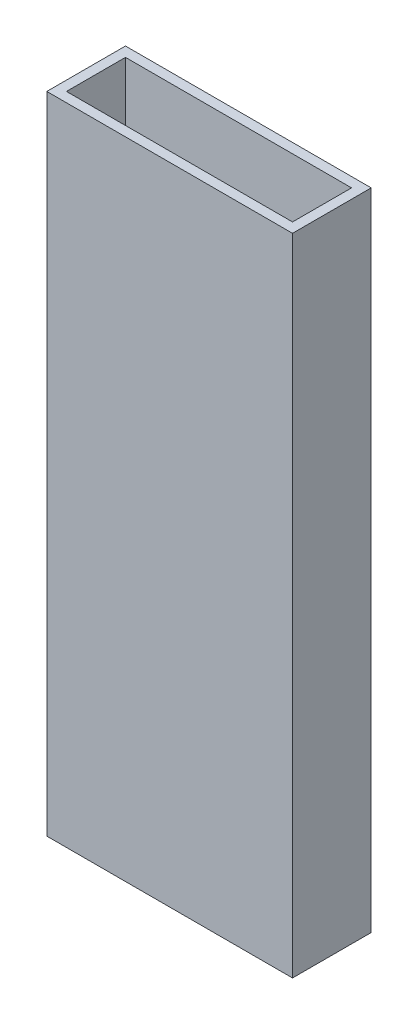
ISO-10303-21;
HEADER;
FILE_DESCRIPTION(('STEP AP214'),'2;1');
FILE_NAME('part.step','',(''),(''),'','','');
FILE_SCHEMA(('AUTOMOTIVE_DESIGN { 1 0 10303 214 1 1 1 1 }'));
ENDSEC;
DATA;
#1=APPLICATION_CONTEXT('core data for automotive mechanical design processes');
#2=APPLICATION_PROTOCOL_DEFINITION('international standard','automotive_design',2000,#1);
#3=PRODUCT_CONTEXT('',#1,'mechanical');
#4=PRODUCT('Part','Part','',(#3));
#5=PRODUCT_RELATED_PRODUCT_CATEGORY('part','',(#4));
#6=PRODUCT_DEFINITION_FORMATION('','',#4);
#7=PRODUCT_DEFINITION_CONTEXT('part definition',#1,'design');
#8=PRODUCT_DEFINITION('design','',#6,#7);
#9=PRODUCT_DEFINITION_SHAPE('','',#8);
#10=(LENGTH_UNIT() NAMED_UNIT(*) SI_UNIT(.MILLI.,.METRE.));
#11=(NAMED_UNIT(*) PLANE_ANGLE_UNIT() SI_UNIT($,.RADIAN.));
#12=(NAMED_UNIT(*) SI_UNIT($,.STERADIAN.) SOLID_ANGLE_UNIT());
#13=UNCERTAINTY_MEASURE_WITH_UNIT(LENGTH_MEASURE(1.E-05),#10,'distance_accuracy_value','');
#14=(GEOMETRIC_REPRESENTATION_CONTEXT(3) GLOBAL_UNCERTAINTY_ASSIGNED_CONTEXT((#13)) GLOBAL_UNIT_ASSIGNED_CONTEXT((#10,
#11,#12)) REPRESENTATION_CONTEXT('',''));
#15=CARTESIAN_POINT('',(0.,0.,0.));
#16=DIRECTION('',(0.,0.,1.));
#17=DIRECTION('',(1.,0.,0.));
#18=AXIS2_PLACEMENT_3D('',#15,#16,#17);
#19=CARTESIAN_POINT('',(0.,200.,0.));
#20=DIRECTION('',(0.,1.,0.));
#21=DIRECTION('',(0.,0.,1.));
#22=AXIS2_PLACEMENT_3D('',#19,#20,#21);
#23=PLANE('',#22);
#24=DIRECTION('',(0.,0.,1.));
#25=VECTOR('',#24,1.);
#26=CARTESIAN_POINT('',(-38.1,200.,-12.2));
#27=LINE('',#26,#25);
#28=CARTESIAN_POINT('',(-38.1,200.,-12.2));
#29=VERTEX_POINT('',#28);
#30=CARTESIAN_POINT('',(-38.1,200.,12.2));
#31=VERTEX_POINT('',#30);
#32=EDGE_CURVE('E153',#29,#31,#27,.T.);
#33=ORIENTED_EDGE('',*,*,#32,.T.);
#34=DIRECTION('',(1.,0.,0.));
#35=VECTOR('',#34,1.);
#36=CARTESIAN_POINT('',(-38.1,200.,12.2));
#37=LINE('',#36,#35);
#38=CARTESIAN_POINT('',(38.1,200.,12.2));
#39=VERTEX_POINT('',#38);
#40=EDGE_CURVE('E157',#31,#39,#37,.T.);
#41=ORIENTED_EDGE('',*,*,#40,.T.);
#42=DIRECTION('',(0.,0.,-1.));
#43=VECTOR('',#42,1.);
#44=CARTESIAN_POINT('',(38.1,200.,-12.2));
#45=LINE('',#44,#43);
#46=CARTESIAN_POINT('',(38.1,200.,-12.2));
#47=VERTEX_POINT('',#46);
#48=EDGE_CURVE('E161',#39,#47,#45,.T.);
#49=ORIENTED_EDGE('',*,*,#48,.T.);
#50=DIRECTION('',(-1.,0.,0.));
#51=VECTOR('',#50,1.);
#52=CARTESIAN_POINT('',(-38.1,200.,-12.2));
#53=LINE('',#52,#51);
#54=EDGE_CURVE('E164',#47,#29,#53,.T.);
#55=ORIENTED_EDGE('',*,*,#54,.T.);
#56=EDGE_LOOP('',(#33,#41,#49,#55));
#57=FACE_BOUND('',#56,.T.);
#58=DIRECTION('',(1.,0.,0.));
#59=VECTOR('',#58,1.);
#60=CARTESIAN_POINT('',(-35.052,200.,9.152));
#61=LINE('',#60,#59);
#62=CARTESIAN_POINT('',(-35.052,200.,9.152));
#63=VERTEX_POINT('',#62);
#64=CARTESIAN_POINT('',(35.052,200.,9.15199999999999));
#65=VERTEX_POINT('',#64);
#66=EDGE_CURVE('E114',#63,#65,#61,.T.);
#67=ORIENTED_EDGE('',*,*,#66,.F.);
#68=DIRECTION('',(0.,0.,1.));
#69=VECTOR('',#68,1.);
#70=CARTESIAN_POINT('',(-35.052,200.,-9.15199999999999));
#71=LINE('',#70,#69);
#72=CARTESIAN_POINT('',(-35.052,200.,-9.15199999999999));
#73=VERTEX_POINT('',#72);
#74=EDGE_CURVE('E105',#73,#63,#71,.T.);
#75=ORIENTED_EDGE('',*,*,#74,.F.);
#76=DIRECTION('',(-1.,0.,0.));
#77=VECTOR('',#76,1.);
#78=CARTESIAN_POINT('',(-35.052,200.,-9.15199999999999));
#79=LINE('',#78,#77);
#80=CARTESIAN_POINT('',(35.052,200.,-9.152));
#81=VERTEX_POINT('',#80);
#82=EDGE_CURVE('E131',#81,#73,#79,.T.);
#83=ORIENTED_EDGE('',*,*,#82,.F.);
#84=DIRECTION('',(0.,0.,-1.));
#85=VECTOR('',#84,1.);
#86=CARTESIAN_POINT('',(35.052,200.,-9.152));
#87=LINE('',#86,#85);
#88=EDGE_CURVE('E127',#65,#81,#87,.T.);
#89=ORIENTED_EDGE('',*,*,#88,.F.);
#90=EDGE_LOOP('',(#67,#75,#83,#89));
#91=FACE_BOUND('',#90,.T.);
#92=ADVANCED_FACE('F39',(#57,#91),#23,.T.);
#93=CARTESIAN_POINT('',(0.,0.,0.));
#94=DIRECTION('',(0.,1.,0.));
#95=DIRECTION('',(0.,0.,1.));
#96=AXIS2_PLACEMENT_3D('',#93,#94,#95);
#97=PLANE('',#96);
#98=DIRECTION('',(0.,0.,1.));
#99=VECTOR('',#98,1.);
#100=CARTESIAN_POINT('',(-38.1,0.,-12.2));
#101=LINE('',#100,#99);
#102=CARTESIAN_POINT('',(-38.1,0.,-12.2));
#103=VERTEX_POINT('',#102);
#104=CARTESIAN_POINT('',(-38.1,0.,12.2));
#105=VERTEX_POINT('',#104);
#106=EDGE_CURVE('E123',#103,#105,#101,.T.);
#107=ORIENTED_EDGE('',*,*,#106,.F.);
#108=DIRECTION('',(-1.,0.,0.));
#109=VECTOR('',#108,1.);
#110=CARTESIAN_POINT('',(-38.1,0.,-12.2));
#111=LINE('',#110,#109);
#112=CARTESIAN_POINT('',(38.1,0.,-12.2));
#113=VERTEX_POINT('',#112);
#114=EDGE_CURVE('E158',#113,#103,#111,.T.);
#115=ORIENTED_EDGE('',*,*,#114,.F.);
#116=DIRECTION('',(0.,0.,-1.));
#117=VECTOR('',#116,1.);
#118=CARTESIAN_POINT('',(38.1,0.,-12.2));
#119=LINE('',#118,#117);
#120=CARTESIAN_POINT('',(38.1,0.,12.2));
#121=VERTEX_POINT('',#120);
#122=EDGE_CURVE('E174',#121,#113,#119,.T.);
#123=ORIENTED_EDGE('',*,*,#122,.F.);
#124=DIRECTION('',(1.,0.,0.));
#125=VECTOR('',#124,1.);
#126=CARTESIAN_POINT('',(-38.1,0.,12.2));
#127=LINE('',#126,#125);
#128=EDGE_CURVE('E171',#105,#121,#127,.T.);
#129=ORIENTED_EDGE('',*,*,#128,.F.);
#130=EDGE_LOOP('',(#107,#115,#123,#129));
#131=FACE_BOUND('',#130,.T.);
#132=DIRECTION('',(0.,0.,1.));
#133=VECTOR('',#132,1.);
#134=CARTESIAN_POINT('',(-35.052,0.,-9.15199999999999));
#135=LINE('',#134,#133);
#136=CARTESIAN_POINT('',(-35.052,0.,-9.15199999999999));
#137=VERTEX_POINT('',#136);
#138=CARTESIAN_POINT('',(-35.052,0.,9.152));
#139=VERTEX_POINT('',#138);
#140=EDGE_CURVE('E63',#137,#139,#135,.T.);
#141=ORIENTED_EDGE('',*,*,#140,.T.);
#142=DIRECTION('',(1.,0.,0.));
#143=VECTOR('',#142,1.);
#144=CARTESIAN_POINT('',(-35.052,0.,9.152));
#145=LINE('',#144,#143);
#146=CARTESIAN_POINT('',(35.052,0.,9.15199999999999));
#147=VERTEX_POINT('',#146);
#148=EDGE_CURVE('E121',#139,#147,#145,.T.);
#149=ORIENTED_EDGE('',*,*,#148,.T.);
#150=DIRECTION('',(0.,0.,-1.));
#151=VECTOR('',#150,1.);
#152=CARTESIAN_POINT('',(35.052,0.,-9.152));
#153=LINE('',#152,#151);
#154=CARTESIAN_POINT('',(35.052,0.,-9.152));
#155=VERTEX_POINT('',#154);
#156=EDGE_CURVE('E140',#147,#155,#153,.T.);
#157=ORIENTED_EDGE('',*,*,#156,.T.);
#158=DIRECTION('',(-1.,0.,0.));
#159=VECTOR('',#158,1.);
#160=CARTESIAN_POINT('',(-35.052,0.,-9.15199999999999));
#161=LINE('',#160,#159);
#162=EDGE_CURVE('E115',#155,#137,#161,.T.);
#163=ORIENTED_EDGE('',*,*,#162,.T.);
#164=EDGE_LOOP('',(#141,#149,#157,#163));
#165=FACE_BOUND('',#164,.T.);
#166=ADVANCED_FACE('F197',(#131,#165),#97,.F.);
#167=CARTESIAN_POINT('',(-38.1,200.,-12.2));
#168=DIRECTION('',(1.,0.,0.));
#169=DIRECTION('',(0.,0.,-1.));
#170=AXIS2_PLACEMENT_3D('',#167,#168,#169);
#171=PLANE('',#170);
#172=ORIENTED_EDGE('',*,*,#106,.T.);
#173=DIRECTION('',(0.,-1.,0.));
#174=VECTOR('',#173,1.);
#175=CARTESIAN_POINT('',(-38.1,200.,12.2));
#176=LINE('',#175,#174);
#177=EDGE_CURVE('E11',#31,#105,#176,.T.);
#178=ORIENTED_EDGE('',*,*,#177,.F.);
#179=ORIENTED_EDGE('',*,*,#32,.F.);
#180=DIRECTION('',(0.,-1.,0.));
#181=VECTOR('',#180,1.);
#182=CARTESIAN_POINT('',(-38.1,200.,-12.2));
#183=LINE('',#182,#181);
#184=EDGE_CURVE('E167',#29,#103,#183,.T.);
#185=ORIENTED_EDGE('',*,*,#184,.T.);
#186=EDGE_LOOP('',(#172,#178,#179,#185));
#187=FACE_BOUND('',#186,.T.);
#188=ADVANCED_FACE('F41',(#187),#171,.F.);
#189=CARTESIAN_POINT('',(-38.1,200.,12.2));
#190=DIRECTION('',(0.,0.,-1.));
#191=DIRECTION('',(-1.,0.,0.));
#192=AXIS2_PLACEMENT_3D('',#189,#190,#191);
#193=PLANE('',#192);
#194=ORIENTED_EDGE('',*,*,#128,.T.);
#195=DIRECTION('',(0.,-1.,0.));
#196=VECTOR('',#195,1.);
#197=CARTESIAN_POINT('',(38.1,200.,12.2));
#198=LINE('',#197,#196);
#199=EDGE_CURVE('E48',#39,#121,#198,.T.);
#200=ORIENTED_EDGE('',*,*,#199,.F.);
#201=ORIENTED_EDGE('',*,*,#40,.F.);
#202=ORIENTED_EDGE('',*,*,#177,.T.);
#203=EDGE_LOOP('',(#194,#200,#201,#202));
#204=FACE_BOUND('',#203,.T.);
#205=ADVANCED_FACE('F207',(#204),#193,.F.);
#206=CARTESIAN_POINT('',(38.1,200.,-12.2));
#207=DIRECTION('',(-1.,0.,0.));
#208=DIRECTION('',(0.,0.,1.));
#209=AXIS2_PLACEMENT_3D('',#206,#207,#208);
#210=PLANE('',#209);
#211=ORIENTED_EDGE('',*,*,#122,.T.);
#212=DIRECTION('',(0.,-1.,0.));
#213=VECTOR('',#212,1.);
#214=CARTESIAN_POINT('',(38.1,200.,-12.2));
#215=LINE('',#214,#213);
#216=EDGE_CURVE('E182',#47,#113,#215,.T.);
#217=ORIENTED_EDGE('',*,*,#216,.F.);
#218=ORIENTED_EDGE('',*,*,#48,.F.);
#219=ORIENTED_EDGE('',*,*,#199,.T.);
#220=EDGE_LOOP('',(#211,#217,#218,#219));
#221=FACE_BOUND('',#220,.T.);
#222=ADVANCED_FACE('F191',(#221),#210,.F.);
#223=CARTESIAN_POINT('',(-38.1,200.,-12.2));
#224=DIRECTION('',(0.,0.,1.));
#225=DIRECTION('',(1.,0.,0.));
#226=AXIS2_PLACEMENT_3D('',#223,#224,#225);
#227=PLANE('',#226);
#228=ORIENTED_EDGE('',*,*,#114,.T.);
#229=ORIENTED_EDGE('',*,*,#184,.F.);
#230=ORIENTED_EDGE('',*,*,#54,.F.);
#231=ORIENTED_EDGE('',*,*,#216,.T.);
#232=EDGE_LOOP('',(#228,#229,#230,#231));
#233=FACE_BOUND('',#232,.T.);
#234=ADVANCED_FACE('F201',(#233),#227,.F.);
#235=CARTESIAN_POINT('',(-35.052,200.,-9.15199999999999));
#236=DIRECTION('',(1.,0.,0.));
#237=DIRECTION('',(0.,0.,-1.));
#238=AXIS2_PLACEMENT_3D('',#235,#236,#237);
#239=PLANE('',#238);
#240=ORIENTED_EDGE('',*,*,#140,.F.);
#241=DIRECTION('',(0.,-1.,0.));
#242=VECTOR('',#241,1.);
#243=CARTESIAN_POINT('',(-35.052,200.,-9.15199999999999));
#244=LINE('',#243,#242);
#245=EDGE_CURVE('E109',#73,#137,#244,.T.);
#246=ORIENTED_EDGE('',*,*,#245,.F.);
#247=ORIENTED_EDGE('',*,*,#74,.T.);
#248=DIRECTION('',(0.,-1.,0.));
#249=VECTOR('',#248,1.);
#250=CARTESIAN_POINT('',(-35.052,200.,9.152));
#251=LINE('',#250,#249);
#252=EDGE_CURVE('E108',#63,#139,#251,.T.);
#253=ORIENTED_EDGE('',*,*,#252,.T.);
#254=EDGE_LOOP('',(#240,#246,#247,#253));
#255=FACE_BOUND('',#254,.T.);
#256=ADVANCED_FACE('F107',(#255),#239,.T.);
#257=CARTESIAN_POINT('',(-35.052,200.,9.152));
#258=DIRECTION('',(0.,0.,-1.));
#259=DIRECTION('',(-1.,0.,0.));
#260=AXIS2_PLACEMENT_3D('',#257,#258,#259);
#261=PLANE('',#260);
#262=ORIENTED_EDGE('',*,*,#148,.F.);
#263=ORIENTED_EDGE('',*,*,#252,.F.);
#264=ORIENTED_EDGE('',*,*,#66,.T.);
#265=DIRECTION('',(0.,-1.,0.));
#266=VECTOR('',#265,1.);
#267=CARTESIAN_POINT('',(35.052,200.,9.15199999999999));
#268=LINE('',#267,#266);
#269=EDGE_CURVE('E124',#65,#147,#268,.T.);
#270=ORIENTED_EDGE('',*,*,#269,.T.);
#271=EDGE_LOOP('',(#262,#263,#264,#270));
#272=FACE_BOUND('',#271,.T.);
#273=ADVANCED_FACE('F118',(#272),#261,.T.);
#274=CARTESIAN_POINT('',(35.052,200.,-9.152));
#275=DIRECTION('',(-1.,0.,0.));
#276=DIRECTION('',(0.,0.,1.));
#277=AXIS2_PLACEMENT_3D('',#274,#275,#276);
#278=PLANE('',#277);
#279=ORIENTED_EDGE('',*,*,#156,.F.);
#280=ORIENTED_EDGE('',*,*,#269,.F.);
#281=ORIENTED_EDGE('',*,*,#88,.T.);
#282=DIRECTION('',(0.,-1.,0.));
#283=VECTOR('',#282,1.);
#284=CARTESIAN_POINT('',(35.052,200.,-9.152));
#285=LINE('',#284,#283);
#286=EDGE_CURVE('E55',#81,#155,#285,.T.);
#287=ORIENTED_EDGE('',*,*,#286,.T.);
#288=EDGE_LOOP('',(#279,#280,#281,#287));
#289=FACE_BOUND('',#288,.T.);
#290=ADVANCED_FACE('F230',(#289),#278,.T.);
#291=CARTESIAN_POINT('',(-35.052,200.,-9.15199999999999));
#292=DIRECTION('',(0.,0.,1.));
#293=DIRECTION('',(1.,0.,0.));
#294=AXIS2_PLACEMENT_3D('',#291,#292,#293);
#295=PLANE('',#294);
#296=ORIENTED_EDGE('',*,*,#162,.F.);
#297=ORIENTED_EDGE('',*,*,#286,.F.);
#298=ORIENTED_EDGE('',*,*,#82,.T.);
#299=ORIENTED_EDGE('',*,*,#245,.T.);
#300=EDGE_LOOP('',(#296,#297,#298,#299));
#301=FACE_BOUND('',#300,.T.);
#302=ADVANCED_FACE('F234',(#301),#295,.T.);
#303=CLOSED_SHELL('',(#92,#166,#188,#205,#222,#234,#256,#273,#290,#302));
#304=MANIFOLD_SOLID_BREP('B2',#303);
#305=ADVANCED_BREP_SHAPE_REPRESENTATION('',(#18,#304),#14);
#306=SHAPE_DEFINITION_REPRESENTATION(#9,#305);
ENDSEC;
END-ISO-10303-21;
